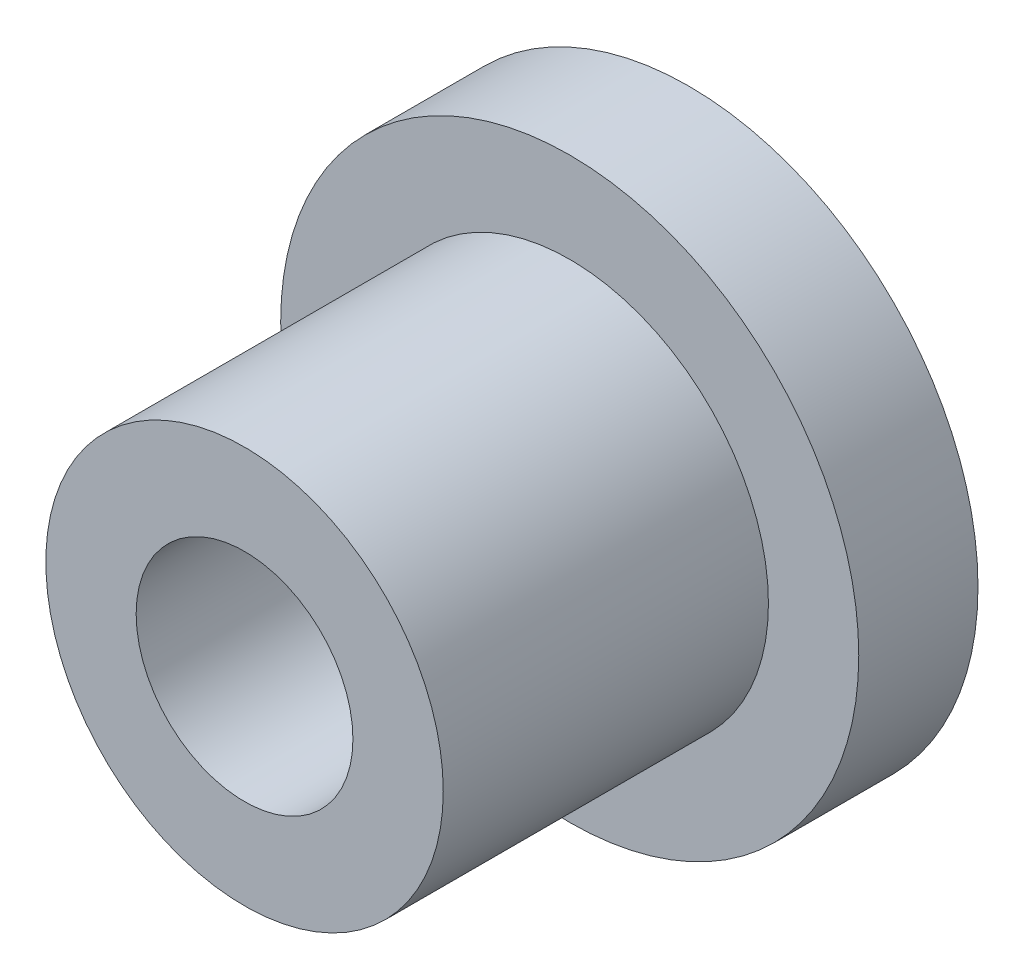
ISO-10303-21;
HEADER;
FILE_DESCRIPTION(('STEP AP214'),'2;1');
FILE_NAME('part.step','',(''),(''),'','','');
FILE_SCHEMA(('AUTOMOTIVE_DESIGN { 1 0 10303 214 1 1 1 1 }'));
ENDSEC;
DATA;
#1=APPLICATION_CONTEXT('core data for automotive mechanical design processes');
#2=APPLICATION_PROTOCOL_DEFINITION('international standard','automotive_design',2000,#1);
#3=PRODUCT_CONTEXT('',#1,'mechanical');
#4=PRODUCT('Part','Part','',(#3));
#5=PRODUCT_RELATED_PRODUCT_CATEGORY('part','',(#4));
#6=PRODUCT_DEFINITION_FORMATION('','',#4);
#7=PRODUCT_DEFINITION_CONTEXT('part definition',#1,'design');
#8=PRODUCT_DEFINITION('design','',#6,#7);
#9=PRODUCT_DEFINITION_SHAPE('','',#8);
#10=(LENGTH_UNIT() NAMED_UNIT(*) SI_UNIT(.MILLI.,.METRE.));
#11=(NAMED_UNIT(*) PLANE_ANGLE_UNIT() SI_UNIT($,.RADIAN.));
#12=(NAMED_UNIT(*) SI_UNIT($,.STERADIAN.) SOLID_ANGLE_UNIT());
#13=UNCERTAINTY_MEASURE_WITH_UNIT(LENGTH_MEASURE(1.E-05),#10,'distance_accuracy_value','');
#14=(GEOMETRIC_REPRESENTATION_CONTEXT(3) GLOBAL_UNCERTAINTY_ASSIGNED_CONTEXT((#13)) GLOBAL_UNIT_ASSIGNED_CONTEXT((#10,
#11,#12)) REPRESENTATION_CONTEXT('',''));
#15=CARTESIAN_POINT('',(0.,0.,0.));
#16=DIRECTION('',(0.,0.,1.));
#17=DIRECTION('',(1.,0.,0.));
#18=AXIS2_PLACEMENT_3D('',#15,#16,#17);
#19=CARTESIAN_POINT('',(0.,0.,3.3));
#20=DIRECTION('',(0.,0.,1.));
#21=DIRECTION('',(1.,0.,0.));
#22=AXIS2_PLACEMENT_3D('',#19,#20,#21);
#23=PLANE('',#22);
#24=CARTESIAN_POINT('',(0.,0.,3.3));
#25=DIRECTION('',(0.,0.,1.));
#26=DIRECTION('',(1.,0.,0.));
#27=AXIS2_PLACEMENT_3D('',#24,#25,#26);
#28=CIRCLE('',#27,8.);
#29=CARTESIAN_POINT('',(8.,0.,3.3));
#30=VERTEX_POINT('',#29);
#31=EDGE_CURVE('E10',#30,#30,#28,.T.);
#32=ORIENTED_EDGE('',*,*,#31,.T.);
#33=EDGE_LOOP('',(#32));
#34=FACE_BOUND('',#33,.T.);
#35=CARTESIAN_POINT('',(0.,0.,3.3));
#36=DIRECTION('',(0.,0.,1.));
#37=DIRECTION('',(1.,0.,0.));
#38=AXIS2_PLACEMENT_3D('',#35,#36,#37);
#39=CIRCLE('',#38,5.5);
#40=CARTESIAN_POINT('',(5.5,0.,3.3));
#41=VERTEX_POINT('',#40);
#42=EDGE_CURVE('E44',#41,#41,#39,.T.);
#43=ORIENTED_EDGE('',*,*,#42,.F.);
#44=EDGE_LOOP('',(#43));
#45=FACE_BOUND('',#44,.T.);
#46=ADVANCED_FACE('F31',(#34,#45),#23,.T.);
#47=CARTESIAN_POINT('',(0.,0.,3.3));
#48=DIRECTION('',(0.,0.,-1.));
#49=DIRECTION('',(-1.,0.,0.));
#50=AXIS2_PLACEMENT_3D('',#47,#48,#49);
#51=CYLINDRICAL_SURFACE('',#50,8.);
#52=ORIENTED_EDGE('',*,*,#31,.F.);
#53=EDGE_LOOP('',(#52));
#54=FACE_BOUND('',#53,.T.);
#55=CARTESIAN_POINT('',(0.,0.,0.));
#56=DIRECTION('',(0.,0.,1.));
#57=DIRECTION('',(1.,0.,0.));
#58=AXIS2_PLACEMENT_3D('',#55,#56,#57);
#59=CIRCLE('',#58,8.);
#60=CARTESIAN_POINT('',(8.,0.,0.));
#61=VERTEX_POINT('',#60);
#62=EDGE_CURVE('E35',#61,#61,#59,.T.);
#63=ORIENTED_EDGE('',*,*,#62,.T.);
#64=EDGE_LOOP('',(#63));
#65=FACE_BOUND('',#64,.T.);
#66=ADVANCED_FACE('F33',(#54,#65),#51,.T.);
#67=CARTESIAN_POINT('',(0.,0.,0.));
#68=DIRECTION('',(0.,0.,1.));
#69=DIRECTION('',(1.,0.,0.));
#70=AXIS2_PLACEMENT_3D('',#67,#68,#69);
#71=PLANE('',#70);
#72=CARTESIAN_POINT('',(0.,0.,0.));
#73=DIRECTION('',(0.,0.,1.));
#74=DIRECTION('',(1.,0.,0.));
#75=AXIS2_PLACEMENT_3D('',#72,#73,#74);
#76=CIRCLE('',#75,6.30000000000001);
#77=CARTESIAN_POINT('',(6.30000000000001,0.,0.));
#78=VERTEX_POINT('',#77);
#79=EDGE_CURVE('E47',#78,#78,#76,.T.);
#80=ORIENTED_EDGE('',*,*,#79,.T.);
#81=EDGE_LOOP('',(#80));
#82=FACE_BOUND('',#81,.T.);
#83=ORIENTED_EDGE('',*,*,#62,.F.);
#84=EDGE_LOOP('',(#83));
#85=FACE_BOUND('',#84,.T.);
#86=ADVANCED_FACE('F72',(#82,#85),#71,.F.);
#87=CARTESIAN_POINT('',(0.,0.,12.3));
#88=DIRECTION('',(0.,0.,-1.));
#89=DIRECTION('',(-1.,0.,0.));
#90=AXIS2_PLACEMENT_3D('',#87,#88,#89);
#91=CYLINDRICAL_SURFACE('',#90,5.5);
#92=CARTESIAN_POINT('',(0.,0.,12.3));
#93=DIRECTION('',(0.,0.,1.));
#94=DIRECTION('',(1.,0.,0.));
#95=AXIS2_PLACEMENT_3D('',#92,#93,#94);
#96=CIRCLE('',#95,5.5);
#97=CARTESIAN_POINT('',(5.5,0.,12.3));
#98=VERTEX_POINT('',#97);
#99=EDGE_CURVE('E42',#98,#98,#96,.T.);
#100=ORIENTED_EDGE('',*,*,#99,.F.);
#101=EDGE_LOOP('',(#100));
#102=FACE_BOUND('',#101,.T.);
#103=ORIENTED_EDGE('',*,*,#42,.T.);
#104=EDGE_LOOP('',(#103));
#105=FACE_BOUND('',#104,.T.);
#106=ADVANCED_FACE('F66',(#102,#105),#91,.T.);
#107=CARTESIAN_POINT('',(0.,0.,12.3));
#108=DIRECTION('',(0.,0.,1.));
#109=DIRECTION('',(1.,0.,0.));
#110=AXIS2_PLACEMENT_3D('',#107,#108,#109);
#111=PLANE('',#110);
#112=CARTESIAN_POINT('',(0.,0.,12.3));
#113=DIRECTION('',(0.,0.,1.));
#114=DIRECTION('',(1.,0.,0.));
#115=AXIS2_PLACEMENT_3D('',#112,#113,#114);
#116=CIRCLE('',#115,3.);
#117=CARTESIAN_POINT('',(3.,0.,12.3));
#118=VERTEX_POINT('',#117);
#119=EDGE_CURVE('E55',#118,#118,#116,.T.);
#120=ORIENTED_EDGE('',*,*,#119,.F.);
#121=EDGE_LOOP('',(#120));
#122=FACE_BOUND('',#121,.T.);
#123=ORIENTED_EDGE('',*,*,#99,.T.);
#124=EDGE_LOOP('',(#123));
#125=FACE_BOUND('',#124,.T.);
#126=ADVANCED_FACE('F62',(#122,#125),#111,.T.);
#127=CARTESIAN_POINT('',(0.,0.,3.3));
#128=DIRECTION('',(0.,0.,-1.));
#129=DIRECTION('',(1.,0.,0.));
#130=AXIS2_PLACEMENT_3D('',#127,#128,#129);
#131=CONICAL_SURFACE('',#130,3.,0.78539816339745);
#132=ORIENTED_EDGE('',*,*,#79,.F.);
#133=EDGE_LOOP('',(#132));
#134=FACE_BOUND('',#133,.T.);
#135=CARTESIAN_POINT('',(0.,0.,3.3));
#136=DIRECTION('',(0.,0.,1.));
#137=DIRECTION('',(1.,0.,0.));
#138=AXIS2_PLACEMENT_3D('',#135,#136,#137);
#139=CIRCLE('',#138,3.);
#140=CARTESIAN_POINT('',(3.,0.,3.3));
#141=VERTEX_POINT('',#140);
#142=EDGE_CURVE('E52',#141,#141,#139,.T.);
#143=ORIENTED_EDGE('',*,*,#142,.T.);
#144=EDGE_LOOP('',(#143));
#145=FACE_BOUND('',#144,.T.);
#146=ADVANCED_FACE('F65',(#134,#145),#131,.F.);
#147=CARTESIAN_POINT('',(0.,0.,0.));
#148=DIRECTION('',(0.,0.,1.));
#149=DIRECTION('',(1.,0.,0.));
#150=AXIS2_PLACEMENT_3D('',#147,#148,#149);
#151=CYLINDRICAL_SURFACE('',#150,3.);
#152=ORIENTED_EDGE('',*,*,#119,.T.);
#153=EDGE_LOOP('',(#152));
#154=FACE_BOUND('',#153,.T.);
#155=ORIENTED_EDGE('',*,*,#142,.F.);
#156=EDGE_LOOP('',(#155));
#157=FACE_BOUND('',#156,.T.);
#158=ADVANCED_FACE('F59',(#154,#157),#151,.F.);
#159=CLOSED_SHELL('',(#46,#66,#86,#106,#126,#146,#158));
#160=MANIFOLD_SOLID_BREP('B2',#159);
#161=ADVANCED_BREP_SHAPE_REPRESENTATION('',(#18,#160),#14);
#162=SHAPE_DEFINITION_REPRESENTATION(#9,#161);
ENDSEC;
END-ISO-10303-21;
